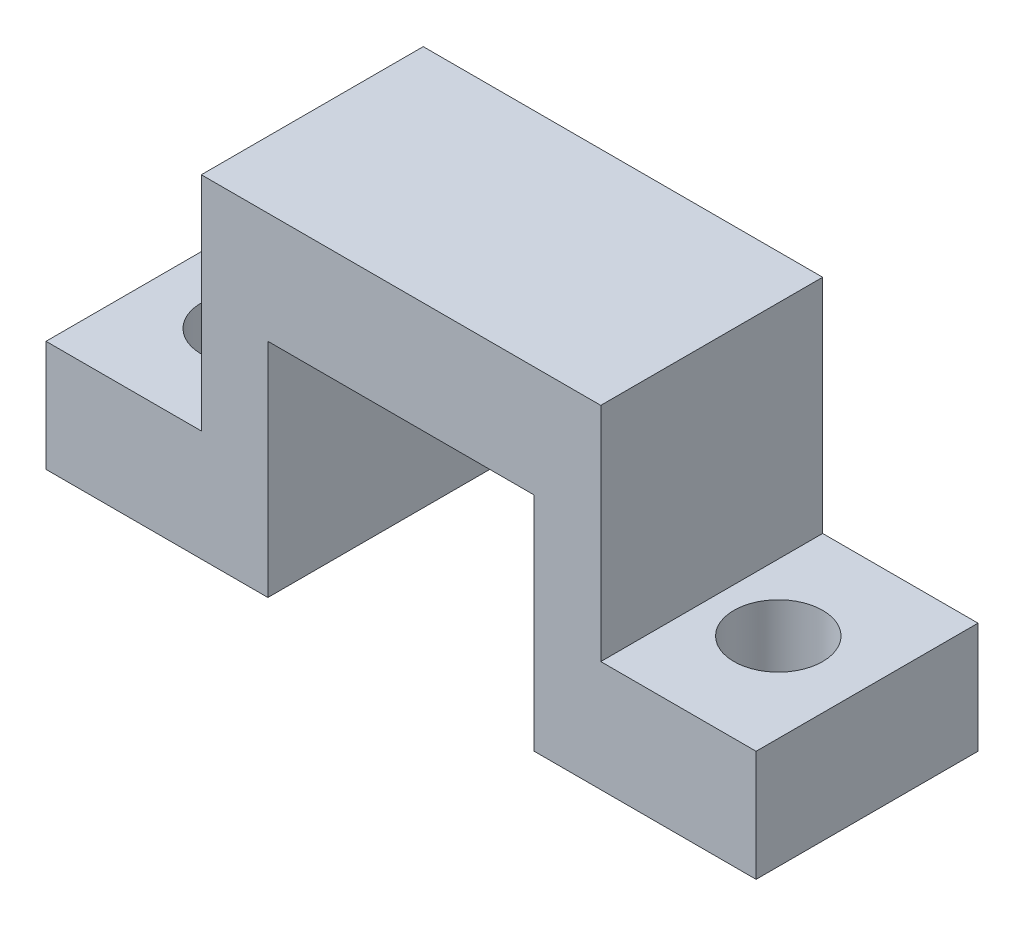
ISO-10303-21;
HEADER;
FILE_DESCRIPTION(('STEP AP214'),'2;1');
FILE_NAME('part.step','',(''),(''),'','','');
FILE_SCHEMA(('AUTOMOTIVE_DESIGN { 1 0 10303 214 1 1 1 1 }'));
ENDSEC;
DATA;
#1=APPLICATION_CONTEXT('core data for automotive mechanical design processes');
#2=APPLICATION_PROTOCOL_DEFINITION('international standard','automotive_design',2000,#1);
#3=PRODUCT_CONTEXT('',#1,'mechanical');
#4=PRODUCT('Part','Part','',(#3));
#5=PRODUCT_RELATED_PRODUCT_CATEGORY('part','',(#4));
#6=PRODUCT_DEFINITION_FORMATION('','',#4);
#7=PRODUCT_DEFINITION_CONTEXT('part definition',#1,'design');
#8=PRODUCT_DEFINITION('design','',#6,#7);
#9=PRODUCT_DEFINITION_SHAPE('','',#8);
#10=(LENGTH_UNIT() NAMED_UNIT(*) SI_UNIT(.MILLI.,.METRE.));
#11=(NAMED_UNIT(*) PLANE_ANGLE_UNIT() SI_UNIT($,.RADIAN.));
#12=(NAMED_UNIT(*) SI_UNIT($,.STERADIAN.) SOLID_ANGLE_UNIT());
#13=UNCERTAINTY_MEASURE_WITH_UNIT(LENGTH_MEASURE(1.E-05),#10,'distance_accuracy_value','');
#14=(GEOMETRIC_REPRESENTATION_CONTEXT(3) GLOBAL_UNCERTAINTY_ASSIGNED_CONTEXT((#13)) GLOBAL_UNIT_ASSIGNED_CONTEXT((#10,
#11,#12)) REPRESENTATION_CONTEXT('',''));
#15=CARTESIAN_POINT('',(0.,0.,0.));
#16=DIRECTION('',(0.,0.,1.));
#17=DIRECTION('',(1.,0.,0.));
#18=AXIS2_PLACEMENT_3D('',#15,#16,#17);
#19=CARTESIAN_POINT('',(9.99999999999999,0.,10.));
#20=DIRECTION('',(0.,1.,0.));
#21=DIRECTION('',(-1.,0.,0.));
#22=AXIS2_PLACEMENT_3D('',#19,#20,#21);
#23=PLANE('',#22);
#24=CARTESIAN_POINT('',(4.,0.,5.));
#25=DIRECTION('',(0.,-1.,0.));
#26=DIRECTION('',(1.,0.,0.));
#27=AXIS2_PLACEMENT_3D('',#24,#25,#26);
#28=CIRCLE('',#27,2.);
#29=CARTESIAN_POINT('',(6.,0.,5.));
#30=VERTEX_POINT('',#29);
#31=EDGE_CURVE('E169',#30,#30,#28,.T.);
#32=ORIENTED_EDGE('',*,*,#31,.F.);
#33=EDGE_LOOP('',(#32));
#34=FACE_BOUND('',#33,.T.);
#35=DIRECTION('',(1.,0.,0.));
#36=VECTOR('',#35,1.);
#37=CARTESIAN_POINT('',(9.99999999999999,0.,0.));
#38=LINE('',#37,#36);
#39=CARTESIAN_POINT('',(0.,0.,0.));
#40=VERTEX_POINT('',#39);
#41=CARTESIAN_POINT('',(9.99999999999999,0.,0.));
#42=VERTEX_POINT('',#41);
#43=EDGE_CURVE('E172',#40,#42,#38,.T.);
#44=ORIENTED_EDGE('',*,*,#43,.T.);
#45=DIRECTION('',(0.,0.,-1.));
#46=VECTOR('',#45,1.);
#47=CARTESIAN_POINT('',(9.99999999999999,0.,10.));
#48=LINE('',#47,#46);
#49=CARTESIAN_POINT('',(9.99999999999999,0.,10.));
#50=VERTEX_POINT('',#49);
#51=EDGE_CURVE('E11',#50,#42,#48,.T.);
#52=ORIENTED_EDGE('',*,*,#51,.F.);
#53=DIRECTION('',(1.,0.,0.));
#54=VECTOR('',#53,1.);
#55=CARTESIAN_POINT('',(9.99999999999999,0.,10.));
#56=LINE('',#55,#54);
#57=CARTESIAN_POINT('',(0.,0.,10.));
#58=VERTEX_POINT('',#57);
#59=EDGE_CURVE('E175',#58,#50,#56,.T.);
#60=ORIENTED_EDGE('',*,*,#59,.F.);
#61=DIRECTION('',(0.,0.,-1.));
#62=VECTOR('',#61,1.);
#63=CARTESIAN_POINT('',(0.,0.,10.));
#64=LINE('',#63,#62);
#65=EDGE_CURVE('E195',#58,#40,#64,.T.);
#66=ORIENTED_EDGE('',*,*,#65,.T.);
#67=EDGE_LOOP('',(#44,#52,#60,#66));
#68=FACE_BOUND('',#67,.T.);
#69=ADVANCED_FACE('F34',(#34,#68),#23,.F.);
#70=CARTESIAN_POINT('',(9.99999999999999,9.99999999999999,10.));
#71=DIRECTION('',(-1.,0.,0.));
#72=DIRECTION('',(0.,0.,1.));
#73=AXIS2_PLACEMENT_3D('',#70,#71,#72);
#74=PLANE('',#73);
#75=DIRECTION('',(0.,1.,0.));
#76=VECTOR('',#75,1.);
#77=CARTESIAN_POINT('',(9.99999999999999,9.99999999999999,0.));
#78=LINE('',#77,#76);
#79=CARTESIAN_POINT('',(9.99999999999999,9.99999999999999,0.));
#80=VERTEX_POINT('',#79);
#81=EDGE_CURVE('E198',#42,#80,#78,.T.);
#82=ORIENTED_EDGE('',*,*,#81,.T.);
#83=DIRECTION('',(0.,0.,-1.));
#84=VECTOR('',#83,1.);
#85=CARTESIAN_POINT('',(9.99999999999999,9.99999999999999,10.));
#86=LINE('',#85,#84);
#87=CARTESIAN_POINT('',(9.99999999999999,9.99999999999999,10.));
#88=VERTEX_POINT('',#87);
#89=EDGE_CURVE('E42',#88,#80,#86,.T.);
#90=ORIENTED_EDGE('',*,*,#89,.F.);
#91=DIRECTION('',(0.,1.,0.));
#92=VECTOR('',#91,1.);
#93=CARTESIAN_POINT('',(9.99999999999999,9.99999999999999,10.));
#94=LINE('',#93,#92);
#95=EDGE_CURVE('E178',#50,#88,#94,.T.);
#96=ORIENTED_EDGE('',*,*,#95,.F.);
#97=ORIENTED_EDGE('',*,*,#51,.T.);
#98=EDGE_LOOP('',(#82,#90,#96,#97));
#99=FACE_BOUND('',#98,.T.);
#100=ADVANCED_FACE('F243',(#99),#74,.F.);
#101=CARTESIAN_POINT('',(9.99999999999999,9.99999999999999,10.));
#102=DIRECTION('',(0.,1.,0.));
#103=DIRECTION('',(0.,0.,1.));
#104=AXIS2_PLACEMENT_3D('',#101,#102,#103);
#105=PLANE('',#104);
#106=DIRECTION('',(1.,0.,0.));
#107=VECTOR('',#106,1.);
#108=CARTESIAN_POINT('',(9.99999999999999,9.99999999999999,0.));
#109=LINE('',#108,#107);
#110=CARTESIAN_POINT('',(22.,9.99999999999999,0.));
#111=VERTEX_POINT('',#110);
#112=EDGE_CURVE('E200',#80,#111,#109,.T.);
#113=ORIENTED_EDGE('',*,*,#112,.T.);
#114=DIRECTION('',(0.,0.,-1.));
#115=VECTOR('',#114,1.);
#116=CARTESIAN_POINT('',(22.,9.99999999999999,10.));
#117=LINE('',#116,#115);
#118=CARTESIAN_POINT('',(22.,9.99999999999999,10.));
#119=VERTEX_POINT('',#118);
#120=EDGE_CURVE('E218',#119,#111,#117,.T.);
#121=ORIENTED_EDGE('',*,*,#120,.F.);
#122=DIRECTION('',(1.,0.,0.));
#123=VECTOR('',#122,1.);
#124=CARTESIAN_POINT('',(9.99999999999999,9.99999999999999,10.));
#125=LINE('',#124,#123);
#126=EDGE_CURVE('E181',#88,#119,#125,.T.);
#127=ORIENTED_EDGE('',*,*,#126,.F.);
#128=ORIENTED_EDGE('',*,*,#89,.T.);
#129=EDGE_LOOP('',(#113,#121,#127,#128));
#130=FACE_BOUND('',#129,.T.);
#131=ADVANCED_FACE('F248',(#130),#105,.F.);
#132=CARTESIAN_POINT('',(22.,9.99999999999999,10.));
#133=DIRECTION('',(1.,0.,0.));
#134=DIRECTION('',(0.,0.,-1.));
#135=AXIS2_PLACEMENT_3D('',#132,#133,#134);
#136=PLANE('',#135);
#137=DIRECTION('',(0.,-1.,0.));
#138=VECTOR('',#137,1.);
#139=CARTESIAN_POINT('',(22.,9.99999999999999,0.));
#140=LINE('',#139,#138);
#141=CARTESIAN_POINT('',(22.,0.,0.));
#142=VERTEX_POINT('',#141);
#143=EDGE_CURVE('E202',#111,#142,#140,.T.);
#144=ORIENTED_EDGE('',*,*,#143,.T.);
#145=DIRECTION('',(0.,0.,-1.));
#146=VECTOR('',#145,1.);
#147=CARTESIAN_POINT('',(22.,0.,10.));
#148=LINE('',#147,#146);
#149=CARTESIAN_POINT('',(22.,0.,10.));
#150=VERTEX_POINT('',#149);
#151=EDGE_CURVE('E215',#150,#142,#148,.T.);
#152=ORIENTED_EDGE('',*,*,#151,.F.);
#153=DIRECTION('',(0.,-1.,0.));
#154=VECTOR('',#153,1.);
#155=CARTESIAN_POINT('',(22.,9.99999999999999,10.));
#156=LINE('',#155,#154);
#157=EDGE_CURVE('E183',#119,#150,#156,.T.);
#158=ORIENTED_EDGE('',*,*,#157,.F.);
#159=ORIENTED_EDGE('',*,*,#120,.T.);
#160=EDGE_LOOP('',(#144,#152,#158,#159));
#161=FACE_BOUND('',#160,.T.);
#162=ADVANCED_FACE('F284',(#161),#136,.F.);
#163=CARTESIAN_POINT('',(22.,0.,10.));
#164=DIRECTION('',(0.,1.,0.));
#165=DIRECTION('',(-1.,0.,0.));
#166=AXIS2_PLACEMENT_3D('',#163,#164,#165);
#167=PLANE('',#166);
#168=CARTESIAN_POINT('',(28.,0.,5.));
#169=DIRECTION('',(0.,-1.,0.));
#170=DIRECTION('',(1.,0.,0.));
#171=AXIS2_PLACEMENT_3D('',#168,#169,#170);
#172=CIRCLE('',#171,2.);
#173=CARTESIAN_POINT('',(30.,0.,5.));
#174=VERTEX_POINT('',#173);
#175=EDGE_CURVE('E168',#174,#174,#172,.T.);
#176=ORIENTED_EDGE('',*,*,#175,.F.);
#177=EDGE_LOOP('',(#176));
#178=FACE_BOUND('',#177,.T.);
#179=DIRECTION('',(1.,0.,0.));
#180=VECTOR('',#179,1.);
#181=CARTESIAN_POINT('',(22.,0.,0.));
#182=LINE('',#181,#180);
#183=CARTESIAN_POINT('',(32.,0.,0.));
#184=VERTEX_POINT('',#183);
#185=EDGE_CURVE('E204',#142,#184,#182,.T.);
#186=ORIENTED_EDGE('',*,*,#185,.T.);
#187=DIRECTION('',(0.,0.,-1.));
#188=VECTOR('',#187,1.);
#189=CARTESIAN_POINT('',(32.,0.,10.));
#190=LINE('',#189,#188);
#191=CARTESIAN_POINT('',(32.,0.,10.));
#192=VERTEX_POINT('',#191);
#193=EDGE_CURVE('E212',#192,#184,#190,.T.);
#194=ORIENTED_EDGE('',*,*,#193,.F.);
#195=DIRECTION('',(1.,0.,0.));
#196=VECTOR('',#195,1.);
#197=CARTESIAN_POINT('',(22.,0.,10.));
#198=LINE('',#197,#196);
#199=EDGE_CURVE('E185',#150,#192,#198,.T.);
#200=ORIENTED_EDGE('',*,*,#199,.F.);
#201=ORIENTED_EDGE('',*,*,#151,.T.);
#202=EDGE_LOOP('',(#186,#194,#200,#201));
#203=FACE_BOUND('',#202,.T.);
#204=ADVANCED_FACE('F279',(#178,#203),#167,.F.);
#205=CARTESIAN_POINT('',(32.,0.,10.));
#206=DIRECTION('',(-1.,0.,0.));
#207=DIRECTION('',(0.,-1.,0.));
#208=AXIS2_PLACEMENT_3D('',#205,#206,#207);
#209=PLANE('',#208);
#210=DIRECTION('',(0.,1.,0.));
#211=VECTOR('',#210,1.);
#212=CARTESIAN_POINT('',(32.,0.,0.));
#213=LINE('',#212,#211);
#214=CARTESIAN_POINT('',(32.,5.,0.));
#215=VERTEX_POINT('',#214);
#216=EDGE_CURVE('E206',#184,#215,#213,.T.);
#217=ORIENTED_EDGE('',*,*,#216,.T.);
#218=DIRECTION('',(0.,0.,-1.));
#219=VECTOR('',#218,1.);
#220=CARTESIAN_POINT('',(32.,5.,20.));
#221=LINE('',#220,#219);
#222=CARTESIAN_POINT('',(32.,5.,10.));
#223=VERTEX_POINT('',#222);
#224=EDGE_CURVE('E50',#223,#215,#221,.T.);
#225=ORIENTED_EDGE('',*,*,#224,.F.);
#226=DIRECTION('',(0.,1.,0.));
#227=VECTOR('',#226,1.);
#228=CARTESIAN_POINT('',(32.,0.,10.));
#229=LINE('',#228,#227);
#230=EDGE_CURVE('E187',#192,#223,#229,.T.);
#231=ORIENTED_EDGE('',*,*,#230,.F.);
#232=ORIENTED_EDGE('',*,*,#193,.T.);
#233=EDGE_LOOP('',(#217,#225,#231,#232));
#234=FACE_BOUND('',#233,.T.);
#235=ADVANCED_FACE('F275',(#234),#209,.F.);
#236=CARTESIAN_POINT('',(32.,15.,10.));
#237=DIRECTION('',(0.,-1.,0.));
#238=DIRECTION('',(1.,0.,0.));
#239=AXIS2_PLACEMENT_3D('',#236,#237,#238);
#240=PLANE('',#239);
#241=DIRECTION('',(-1.,0.,0.));
#242=VECTOR('',#241,1.);
#243=CARTESIAN_POINT('',(32.,15.,10.));
#244=LINE('',#243,#242);
#245=CARTESIAN_POINT('',(25.,15.,10.));
#246=VERTEX_POINT('',#245);
#247=CARTESIAN_POINT('',(7.,15.,10.));
#248=VERTEX_POINT('',#247);
#249=EDGE_CURVE('E190',#246,#248,#244,.T.);
#250=ORIENTED_EDGE('',*,*,#249,.F.);
#251=DIRECTION('',(0.,0.,-1.));
#252=VECTOR('',#251,1.);
#253=CARTESIAN_POINT('',(25.,15.,20.));
#254=LINE('',#253,#252);
#255=CARTESIAN_POINT('',(25.,15.,0.));
#256=VERTEX_POINT('',#255);
#257=EDGE_CURVE('E133',#246,#256,#254,.T.);
#258=ORIENTED_EDGE('',*,*,#257,.T.);
#259=DIRECTION('',(-1.,0.,0.));
#260=VECTOR('',#259,1.);
#261=CARTESIAN_POINT('',(32.,15.,0.));
#262=LINE('',#261,#260);
#263=CARTESIAN_POINT('',(7.,15.,0.));
#264=VERTEX_POINT('',#263);
#265=EDGE_CURVE('E146',#256,#264,#262,.T.);
#266=ORIENTED_EDGE('',*,*,#265,.T.);
#267=DIRECTION('',(0.,0.,-1.));
#268=VECTOR('',#267,1.);
#269=CARTESIAN_POINT('',(7.,15.,20.));
#270=LINE('',#269,#268);
#271=EDGE_CURVE('E58',#248,#264,#270,.T.);
#272=ORIENTED_EDGE('',*,*,#271,.F.);
#273=EDGE_LOOP('',(#250,#258,#266,#272));
#274=FACE_BOUND('',#273,.T.);
#275=ADVANCED_FACE('F272',(#274),#240,.F.);
#276=CARTESIAN_POINT('',(0.,15.,10.));
#277=DIRECTION('',(1.,0.,0.));
#278=DIRECTION('',(0.,0.,-1.));
#279=AXIS2_PLACEMENT_3D('',#276,#277,#278);
#280=PLANE('',#279);
#281=DIRECTION('',(0.,-1.,0.));
#282=VECTOR('',#281,1.);
#283=CARTESIAN_POINT('',(0.,15.,10.));
#284=LINE('',#283,#282);
#285=CARTESIAN_POINT('',(0.,4.99999999999999,10.));
#286=VERTEX_POINT('',#285);
#287=EDGE_CURVE('E193',#286,#58,#284,.T.);
#288=ORIENTED_EDGE('',*,*,#287,.F.);
#289=DIRECTION('',(0.,0.,-1.));
#290=VECTOR('',#289,1.);
#291=CARTESIAN_POINT('',(0.,4.99999999999999,20.));
#292=LINE('',#291,#290);
#293=CARTESIAN_POINT('',(0.,4.99999999999999,0.));
#294=VERTEX_POINT('',#293);
#295=EDGE_CURVE('E141',#286,#294,#292,.T.);
#296=ORIENTED_EDGE('',*,*,#295,.T.);
#297=DIRECTION('',(0.,-1.,0.));
#298=VECTOR('',#297,1.);
#299=CARTESIAN_POINT('',(0.,15.,0.));
#300=LINE('',#299,#298);
#301=EDGE_CURVE('E179',#294,#40,#300,.T.);
#302=ORIENTED_EDGE('',*,*,#301,.T.);
#303=ORIENTED_EDGE('',*,*,#65,.F.);
#304=EDGE_LOOP('',(#288,#296,#302,#303));
#305=FACE_BOUND('',#304,.T.);
#306=ADVANCED_FACE('F268',(#305),#280,.F.);
#307=CARTESIAN_POINT('',(0.,0.,10.));
#308=DIRECTION('',(0.,0.,1.));
#309=DIRECTION('',(1.,0.,0.));
#310=AXIS2_PLACEMENT_3D('',#307,#308,#309);
#311=PLANE('',#310);
#312=DIRECTION('',(0.,-1.,0.));
#313=VECTOR('',#312,1.);
#314=CARTESIAN_POINT('',(25.,0.,10.));
#315=LINE('',#314,#313);
#316=CARTESIAN_POINT('',(25.,5.,10.));
#317=VERTEX_POINT('',#316);
#318=EDGE_CURVE('E131',#246,#317,#315,.T.);
#319=ORIENTED_EDGE('',*,*,#318,.F.);
#320=ORIENTED_EDGE('',*,*,#249,.T.);
#321=DIRECTION('',(0.,1.,0.));
#322=VECTOR('',#321,1.);
#323=CARTESIAN_POINT('',(7.,0.,10.));
#324=LINE('',#323,#322);
#325=CARTESIAN_POINT('',(7.,4.99999999999999,10.));
#326=VERTEX_POINT('',#325);
#327=EDGE_CURVE('E165',#326,#248,#324,.T.);
#328=ORIENTED_EDGE('',*,*,#327,.F.);
#329=DIRECTION('',(1.,0.,0.));
#330=VECTOR('',#329,1.);
#331=CARTESIAN_POINT('',(0.,4.99999999999999,10.));
#332=LINE('',#331,#330);
#333=EDGE_CURVE('E161',#286,#326,#332,.T.);
#334=ORIENTED_EDGE('',*,*,#333,.F.);
#335=ORIENTED_EDGE('',*,*,#287,.T.);
#336=ORIENTED_EDGE('',*,*,#59,.T.);
#337=ORIENTED_EDGE('',*,*,#95,.T.);
#338=ORIENTED_EDGE('',*,*,#126,.T.);
#339=ORIENTED_EDGE('',*,*,#157,.T.);
#340=ORIENTED_EDGE('',*,*,#199,.T.);
#341=ORIENTED_EDGE('',*,*,#230,.T.);
#342=DIRECTION('',(1.,0.,0.));
#343=VECTOR('',#342,1.);
#344=CARTESIAN_POINT('',(0.,5.,10.));
#345=LINE('',#344,#343);
#346=EDGE_CURVE('E163',#317,#223,#345,.T.);
#347=ORIENTED_EDGE('',*,*,#346,.F.);
#348=EDGE_LOOP('',(#319,#320,#328,#334,#335,#336,#337,#338,#339,#340,#341,#347));
#349=FACE_BOUND('',#348,.T.);
#350=ADVANCED_FACE('F263',(#349),#311,.T.);
#351=CARTESIAN_POINT('',(0.,0.,0.));
#352=DIRECTION('',(0.,0.,1.));
#353=DIRECTION('',(1.,0.,0.));
#354=AXIS2_PLACEMENT_3D('',#351,#352,#353);
#355=PLANE('',#354);
#356=ORIENTED_EDGE('',*,*,#265,.F.);
#357=DIRECTION('',(0.,1.,0.));
#358=VECTOR('',#357,1.);
#359=CARTESIAN_POINT('',(25.,15.,0.));
#360=LINE('',#359,#358);
#361=CARTESIAN_POINT('',(25.,5.,0.));
#362=VERTEX_POINT('',#361);
#363=EDGE_CURVE('E128',#362,#256,#360,.T.);
#364=ORIENTED_EDGE('',*,*,#363,.F.);
#365=DIRECTION('',(-1.,0.,0.));
#366=VECTOR('',#365,1.);
#367=CARTESIAN_POINT('',(32.,5.,0.));
#368=LINE('',#367,#366);
#369=EDGE_CURVE('E135',#215,#362,#368,.T.);
#370=ORIENTED_EDGE('',*,*,#369,.F.);
#371=ORIENTED_EDGE('',*,*,#216,.F.);
#372=ORIENTED_EDGE('',*,*,#185,.F.);
#373=ORIENTED_EDGE('',*,*,#143,.F.);
#374=ORIENTED_EDGE('',*,*,#112,.F.);
#375=ORIENTED_EDGE('',*,*,#81,.F.);
#376=ORIENTED_EDGE('',*,*,#43,.F.);
#377=ORIENTED_EDGE('',*,*,#301,.F.);
#378=DIRECTION('',(-1.,0.,0.));
#379=VECTOR('',#378,1.);
#380=CARTESIAN_POINT('',(0.,4.99999999999999,0.));
#381=LINE('',#380,#379);
#382=CARTESIAN_POINT('',(7.,4.99999999999999,0.));
#383=VERTEX_POINT('',#382);
#384=EDGE_CURVE('E154',#383,#294,#381,.T.);
#385=ORIENTED_EDGE('',*,*,#384,.F.);
#386=DIRECTION('',(0.,-1.,0.));
#387=VECTOR('',#386,1.);
#388=CARTESIAN_POINT('',(7.,15.,0.));
#389=LINE('',#388,#387);
#390=EDGE_CURVE('E152',#264,#383,#389,.T.);
#391=ORIENTED_EDGE('',*,*,#390,.F.);
#392=EDGE_LOOP('',(#356,#364,#370,#371,#372,#373,#374,#375,#376,#377,#385,#391));
#393=FACE_BOUND('',#392,.T.);
#394=ADVANCED_FACE('F144',(#393),#355,.F.);
#395=CARTESIAN_POINT('',(28.,20.,5.));
#396=DIRECTION('',(0.,-1.,0.));
#397=DIRECTION('',(1.,0.,0.));
#398=AXIS2_PLACEMENT_3D('',#395,#396,#397);
#399=CYLINDRICAL_SURFACE('',#398,2.);
#400=CARTESIAN_POINT('',(28.,5.,5.));
#401=DIRECTION('',(0.,-1.,0.));
#402=DIRECTION('',(0.,0.,-1.));
#403=AXIS2_PLACEMENT_3D('',#400,#401,#402);
#404=CIRCLE('',#403,2.);
#405=CARTESIAN_POINT('',(28.,5.,3.));
#406=VERTEX_POINT('',#405);
#407=EDGE_CURVE('E37',#406,#406,#404,.F.);
#408=ORIENTED_EDGE('',*,*,#407,.T.);
#409=EDGE_LOOP('',(#408));
#410=FACE_BOUND('',#409,.T.);
#411=ORIENTED_EDGE('',*,*,#175,.T.);
#412=EDGE_LOOP('',(#411));
#413=FACE_BOUND('',#412,.T.);
#414=ADVANCED_FACE('F239',(#410,#413),#399,.F.);
#415=CARTESIAN_POINT('',(4.00000000000002,20.,5.));
#416=DIRECTION('',(0.,-1.,0.));
#417=DIRECTION('',(1.,0.,0.));
#418=AXIS2_PLACEMENT_3D('',#415,#416,#417);
#419=CYLINDRICAL_SURFACE('',#418,2.);
#420=CARTESIAN_POINT('',(4.00000000000001,4.99999999999999,5.));
#421=DIRECTION('',(0.,-1.,0.));
#422=DIRECTION('',(1.,0.,0.));
#423=AXIS2_PLACEMENT_3D('',#420,#421,#422);
#424=CIRCLE('',#423,2.);
#425=CARTESIAN_POINT('',(6.00000000000001,4.99999999999999,5.));
#426=VERTEX_POINT('',#425);
#427=EDGE_CURVE('E150',#426,#426,#424,.F.);
#428=ORIENTED_EDGE('',*,*,#427,.T.);
#429=EDGE_LOOP('',(#428));
#430=FACE_BOUND('',#429,.T.);
#431=ORIENTED_EDGE('',*,*,#31,.T.);
#432=EDGE_LOOP('',(#431));
#433=FACE_BOUND('',#432,.T.);
#434=ADVANCED_FACE('F225',(#430,#433),#419,.F.);
#435=CARTESIAN_POINT('',(0.,4.99999999999999,20.));
#436=DIRECTION('',(0.,-1.,0.));
#437=DIRECTION('',(1.,0.,0.));
#438=AXIS2_PLACEMENT_3D('',#435,#436,#437);
#439=PLANE('',#438);
#440=ORIENTED_EDGE('',*,*,#333,.T.);
#441=DIRECTION('',(0.,0.,-1.));
#442=VECTOR('',#441,1.);
#443=CARTESIAN_POINT('',(7.,4.99999999999999,20.));
#444=LINE('',#443,#442);
#445=EDGE_CURVE('E158',#326,#383,#444,.T.);
#446=ORIENTED_EDGE('',*,*,#445,.T.);
#447=ORIENTED_EDGE('',*,*,#384,.T.);
#448=ORIENTED_EDGE('',*,*,#295,.F.);
#449=EDGE_LOOP('',(#440,#446,#447,#448));
#450=FACE_BOUND('',#449,.T.);
#451=ORIENTED_EDGE('',*,*,#427,.F.);
#452=EDGE_LOOP('',(#451));
#453=FACE_BOUND('',#452,.T.);
#454=ADVANCED_FACE('F228',(#450,#453),#439,.F.);
#455=CARTESIAN_POINT('',(7.,15.,20.));
#456=DIRECTION('',(1.,0.,0.));
#457=DIRECTION('',(0.,1.,0.));
#458=AXIS2_PLACEMENT_3D('',#455,#456,#457);
#459=PLANE('',#458);
#460=ORIENTED_EDGE('',*,*,#327,.T.);
#461=ORIENTED_EDGE('',*,*,#271,.T.);
#462=ORIENTED_EDGE('',*,*,#390,.T.);
#463=ORIENTED_EDGE('',*,*,#445,.F.);
#464=EDGE_LOOP('',(#460,#461,#462,#463));
#465=FACE_BOUND('',#464,.T.);
#466=ADVANCED_FACE('F230',(#465),#459,.F.);
#467=CARTESIAN_POINT('',(32.,5.,20.));
#468=DIRECTION('',(0.,-1.,0.));
#469=DIRECTION('',(0.,0.,-1.));
#470=AXIS2_PLACEMENT_3D('',#467,#468,#469);
#471=PLANE('',#470);
#472=ORIENTED_EDGE('',*,*,#346,.T.);
#473=ORIENTED_EDGE('',*,*,#224,.T.);
#474=ORIENTED_EDGE('',*,*,#369,.T.);
#475=DIRECTION('',(0.,0.,-1.));
#476=VECTOR('',#475,1.);
#477=CARTESIAN_POINT('',(25.,5.,20.));
#478=LINE('',#477,#476);
#479=EDGE_CURVE('E125',#317,#362,#478,.T.);
#480=ORIENTED_EDGE('',*,*,#479,.F.);
#481=EDGE_LOOP('',(#472,#473,#474,#480));
#482=FACE_BOUND('',#481,.T.);
#483=ORIENTED_EDGE('',*,*,#407,.F.);
#484=EDGE_LOOP('',(#483));
#485=FACE_BOUND('',#484,.T.);
#486=ADVANCED_FACE('F136',(#482,#485),#471,.F.);
#487=CARTESIAN_POINT('',(25.,15.,20.));
#488=DIRECTION('',(-1.,0.,0.));
#489=DIRECTION('',(0.,0.,1.));
#490=AXIS2_PLACEMENT_3D('',#487,#488,#489);
#491=PLANE('',#490);
#492=ORIENTED_EDGE('',*,*,#318,.T.);
#493=ORIENTED_EDGE('',*,*,#479,.T.);
#494=ORIENTED_EDGE('',*,*,#363,.T.);
#495=ORIENTED_EDGE('',*,*,#257,.F.);
#496=EDGE_LOOP('',(#492,#493,#494,#495));
#497=FACE_BOUND('',#496,.T.);
#498=ADVANCED_FACE('F126',(#497),#491,.F.);
#499=CLOSED_SHELL('',(#69,#100,#131,#162,#204,#235,#275,#306,#350,#394,#414,#434,#454,#466,#486,#498));
#500=MANIFOLD_SOLID_BREP('B2',#499);
#501=ADVANCED_BREP_SHAPE_REPRESENTATION('',(#18,#500),#14);
#502=SHAPE_DEFINITION_REPRESENTATION(#9,#501);
ENDSEC;
END-ISO-10303-21;
